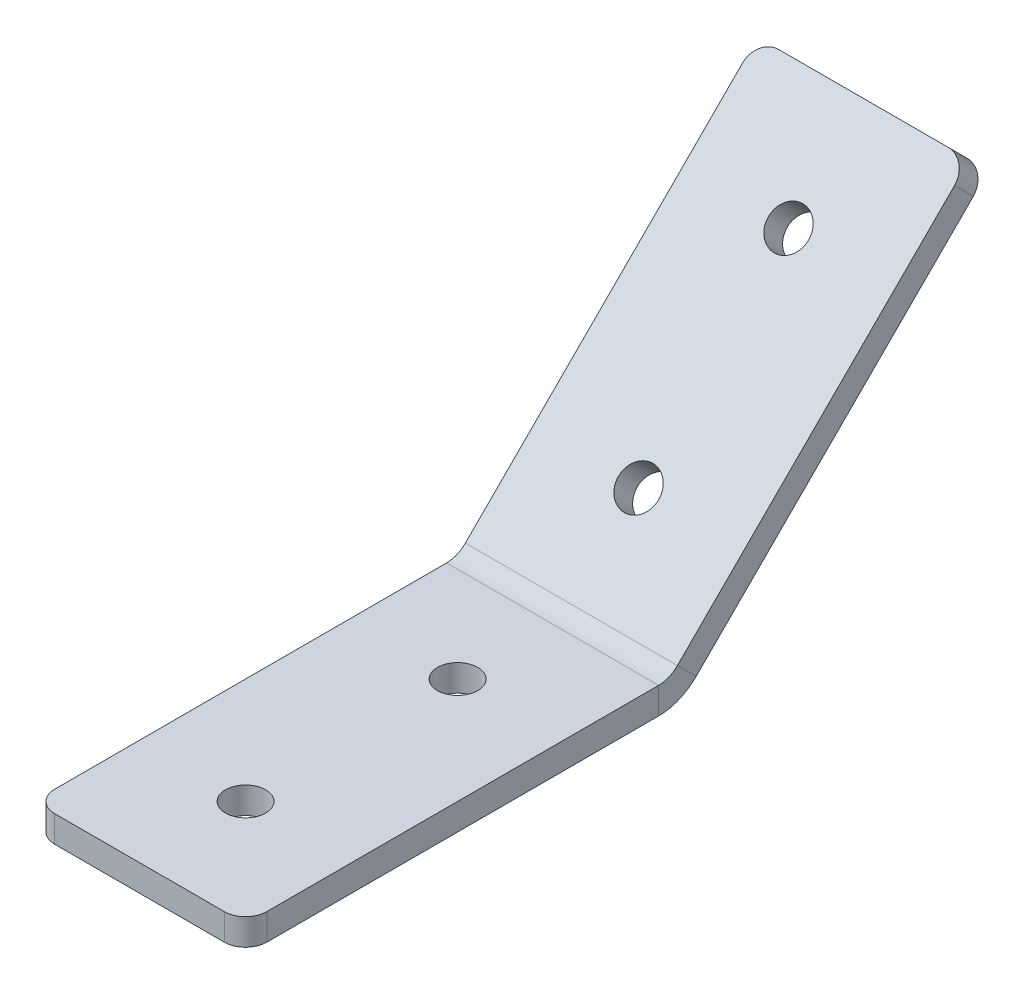
ISO-10303-21;
HEADER;
FILE_DESCRIPTION(('STEP AP214'),'2;1');
FILE_NAME('part.step','',(''),(''),'','','');
FILE_SCHEMA(('AUTOMOTIVE_DESIGN { 1 0 10303 214 1 1 1 1 }'));
ENDSEC;
DATA;
#1=APPLICATION_CONTEXT('core data for automotive mechanical design processes');
#2=APPLICATION_PROTOCOL_DEFINITION('international standard','automotive_design',2000,#1);
#3=PRODUCT_CONTEXT('',#1,'mechanical');
#4=PRODUCT('Part','Part','',(#3));
#5=PRODUCT_RELATED_PRODUCT_CATEGORY('part','',(#4));
#6=PRODUCT_DEFINITION_FORMATION('','',#4);
#7=PRODUCT_DEFINITION_CONTEXT('part definition',#1,'design');
#8=PRODUCT_DEFINITION('design','',#6,#7);
#9=PRODUCT_DEFINITION_SHAPE('','',#8);
#10=(LENGTH_UNIT() NAMED_UNIT(*) SI_UNIT(.MILLI.,.METRE.));
#11=(NAMED_UNIT(*) PLANE_ANGLE_UNIT() SI_UNIT($,.RADIAN.));
#12=(NAMED_UNIT(*) SI_UNIT($,.STERADIAN.) SOLID_ANGLE_UNIT());
#13=UNCERTAINTY_MEASURE_WITH_UNIT(LENGTH_MEASURE(1.E-05),#10,'distance_accuracy_value','');
#14=(GEOMETRIC_REPRESENTATION_CONTEXT(3) GLOBAL_UNCERTAINTY_ASSIGNED_CONTEXT((#13)) GLOBAL_UNIT_ASSIGNED_CONTEXT((#10,
#11,#12)) REPRESENTATION_CONTEXT('',''));
#15=CARTESIAN_POINT('',(0.,0.,0.));
#16=DIRECTION('',(0.,0.,1.));
#17=DIRECTION('',(1.,0.,0.));
#18=AXIS2_PLACEMENT_3D('',#15,#16,#17);
#19=CARTESIAN_POINT('',(0.,0.,-52.1151280605346));
#20=DIRECTION('',(1.,0.,0.));
#21=DIRECTION('',(0.,0.707106781186549,-0.707106781186546));
#22=AXIS2_PLACEMENT_3D('',#19,#20,#21);
#23=PLANE('',#22);
#24=DIRECTION('',(0.,-0.707106781186549,0.707106781186546));
#25=VECTOR('',#24,1.);
#26=CARTESIAN_POINT('',(0.,2.24506403026728,-49.8700640302673));
#27=LINE('',#26,#25);
#28=CARTESIAN_POINT('',(0.,4.10493596973272,-51.7299359697327));
#29=VERTEX_POINT('',#28);
#30=CARTESIAN_POINT('',(0.,37.2999732600629,-84.9249732600627));
#31=VERTEX_POINT('',#30);
#32=EDGE_CURVE('E225',#29,#31,#27,.F.);
#33=ORIENTED_EDGE('',*,*,#32,.T.);
#34=DIRECTION('',(0.,-0.707106781186546,-0.707106781186549));
#35=VECTOR('',#34,1.);
#36=CARTESIAN_POINT('',(0.,35.0549092297956,-87.17003729033));
#37=LINE('',#36,#35);
#38=CARTESIAN_POINT('',(0.,35.0549092297956,-87.17003729033));
#39=VERTEX_POINT('',#38);
#40=EDGE_CURVE('E11',#31,#39,#37,.T.);
#41=ORIENTED_EDGE('',*,*,#40,.T.);
#42=DIRECTION('',(0.,0.707106781186549,-0.707106781186546));
#43=VECTOR('',#42,1.);
#44=CARTESIAN_POINT('',(0.,0.,-52.1151280605346));
#45=LINE('',#44,#43);
#46=CARTESIAN_POINT('',(0.,1.85987193946543,-53.975));
#47=VERTEX_POINT('',#46);
#48=EDGE_CURVE('E161',#47,#39,#45,.T.);
#49=ORIENTED_EDGE('',*,*,#48,.F.);
#50=DIRECTION('',(0.,-0.707106781186546,-0.707106781186549));
#51=VECTOR('',#50,1.);
#52=CARTESIAN_POINT('',(0.,1.85987193946543,-53.975));
#53=LINE('',#52,#51);
#54=EDGE_CURVE('E133',#29,#47,#53,.T.);
#55=ORIENTED_EDGE('',*,*,#54,.F.);
#56=EDGE_LOOP('',(#33,#41,#49,#55));
#57=FACE_BOUND('',#56,.T.);
#58=ADVANCED_FACE('F39',(#57),#23,.F.);
#59=CARTESIAN_POINT('',(25.4,36.8509604540094,-88.9660885145438));
#60=DIRECTION('',(0.,0.707106781186549,-0.707106781186546));
#61=DIRECTION('',(-1.,0.,0.));
#62=AXIS2_PLACEMENT_3D('',#59,#60,#61);
#63=PLANE('',#62);
#64=DIRECTION('',(1.,0.,0.));
#65=VECTOR('',#64,1.);
#66=CARTESIAN_POINT('',(25.4,39.0960244842767,-86.7210244842765));
#67=LINE('',#66,#65);
#68=CARTESIAN_POINT('',(22.86,39.0960244842767,-86.7210244842765));
#69=VERTEX_POINT('',#68);
#70=CARTESIAN_POINT('',(2.53999999999999,39.0960244842767,-86.7210244842765));
#71=VERTEX_POINT('',#70);
#72=EDGE_CURVE('E222',#69,#71,#67,.F.);
#73=ORIENTED_EDGE('',*,*,#72,.F.);
#74=DIRECTION('',(0.,-0.707106781186546,-0.707106781186549));
#75=VECTOR('',#74,1.);
#76=CARTESIAN_POINT('',(22.86,36.8509604540094,-88.9660885145438));
#77=LINE('',#76,#75);
#78=CARTESIAN_POINT('',(22.86,36.8509604540094,-88.9660885145438));
#79=VERTEX_POINT('',#78);
#80=EDGE_CURVE('E273',#69,#79,#77,.T.);
#81=ORIENTED_EDGE('',*,*,#80,.T.);
#82=DIRECTION('',(-1.,0.,0.));
#83=VECTOR('',#82,1.);
#84=CARTESIAN_POINT('',(25.4,36.8509604540094,-88.9660885145438));
#85=LINE('',#84,#83);
#86=CARTESIAN_POINT('',(2.54,36.8509604540094,-88.9660885145438));
#87=VERTEX_POINT('',#86);
#88=EDGE_CURVE('E165',#79,#87,#85,.T.);
#89=ORIENTED_EDGE('',*,*,#88,.T.);
#90=DIRECTION('',(0.,0.707106781186546,0.707106781186549));
#91=VECTOR('',#90,1.);
#92=CARTESIAN_POINT('',(2.54,36.8509604540094,-88.9660885145438));
#93=LINE('',#92,#91);
#94=EDGE_CURVE('E270',#87,#71,#93,.T.);
#95=ORIENTED_EDGE('',*,*,#94,.T.);
#96=EDGE_LOOP('',(#73,#81,#89,#95));
#97=FACE_BOUND('',#96,.T.);
#98=ADVANCED_FACE('F294',(#97),#63,.T.);
#99=CARTESIAN_POINT('',(25.4,0.,-52.1151280605346));
#100=DIRECTION('',(1.,0.,0.));
#101=DIRECTION('',(0.,0.707106781186549,-0.707106781186546));
#102=AXIS2_PLACEMENT_3D('',#99,#100,#101);
#103=PLANE('',#102);
#104=DIRECTION('',(0.,0.707106781186549,-0.707106781186546));
#105=VECTOR('',#104,1.);
#106=CARTESIAN_POINT('',(25.4,0.,-52.1151280605346));
#107=LINE('',#106,#105);
#108=CARTESIAN_POINT('',(25.4,1.85987193946543,-53.975));
#109=VERTEX_POINT('',#108);
#110=CARTESIAN_POINT('',(25.4,35.0549092297956,-87.17003729033));
#111=VERTEX_POINT('',#110);
#112=EDGE_CURVE('E171',#109,#111,#107,.T.);
#113=ORIENTED_EDGE('',*,*,#112,.T.);
#114=DIRECTION('',(0.,-0.707106781186546,-0.707106781186549));
#115=VECTOR('',#114,1.);
#116=CARTESIAN_POINT('',(25.4,35.0549092297956,-87.17003729033));
#117=LINE('',#116,#115);
#118=CARTESIAN_POINT('',(25.4,37.2999732600629,-84.9249732600627));
#119=VERTEX_POINT('',#118);
#120=EDGE_CURVE('E63',#111,#119,#117,.F.);
#121=ORIENTED_EDGE('',*,*,#120,.T.);
#122=DIRECTION('',(0.,-0.707106781186549,0.707106781186546));
#123=VECTOR('',#122,1.);
#124=CARTESIAN_POINT('',(25.4,2.24506403026728,-49.8700640302673));
#125=LINE('',#124,#123);
#126=CARTESIAN_POINT('',(25.4,4.10493596973271,-51.7299359697327));
#127=VERTEX_POINT('',#126);
#128=EDGE_CURVE('E202',#127,#119,#125,.F.);
#129=ORIENTED_EDGE('',*,*,#128,.F.);
#130=DIRECTION('',(0.,-0.707106781186546,-0.707106781186549));
#131=VECTOR('',#130,1.);
#132=CARTESIAN_POINT('',(25.4,1.85987193946543,-53.975));
#133=LINE('',#132,#131);
#134=EDGE_CURVE('E146',#127,#109,#133,.T.);
#135=ORIENTED_EDGE('',*,*,#134,.T.);
#136=EDGE_LOOP('',(#113,#121,#129,#135));
#137=FACE_BOUND('',#136,.T.);
#138=ADVANCED_FACE('F298',(#137),#103,.T.);
#139=CARTESIAN_POINT('',(25.4,6.35,-49.4848719394654));
#140=DIRECTION('',(-1.,0.,0.));
#141=DIRECTION('',(0.,0.,1.));
#142=AXIS2_PLACEMENT_3D('',#139,#140,#141);
#143=PLANE('',#142);
#144=ORIENTED_EDGE('',*,*,#134,.F.);
#145=CARTESIAN_POINT('',(25.4,6.35,-49.4848719394654));
#146=DIRECTION('',(-1.,0.,0.));
#147=DIRECTION('',(0.,0.,1.));
#148=AXIS2_PLACEMENT_3D('',#145,#146,#147);
#149=CIRCLE('',#148,3.175);
#150=CARTESIAN_POINT('',(25.4,3.175,-49.4848719394654));
#151=VERTEX_POINT('',#150);
#152=EDGE_CURVE('E215',#127,#151,#149,.T.);
#153=ORIENTED_EDGE('',*,*,#152,.T.);
#154=DIRECTION('',(0.,-1.,0.));
#155=VECTOR('',#154,1.);
#156=CARTESIAN_POINT('',(25.4,0.,-49.4848719394654));
#157=LINE('',#156,#155);
#158=CARTESIAN_POINT('',(25.4,0.,-49.4848719394654));
#159=VERTEX_POINT('',#158);
#160=EDGE_CURVE('E236',#151,#159,#157,.T.);
#161=ORIENTED_EDGE('',*,*,#160,.T.);
#162=CARTESIAN_POINT('',(25.4,6.35,-49.4848719394654));
#163=DIRECTION('',(1.,0.,0.));
#164=DIRECTION('',(0.,0.,-1.));
#165=AXIS2_PLACEMENT_3D('',#162,#163,#164);
#166=CIRCLE('',#165,6.35);
#167=EDGE_CURVE('E157',#109,#159,#166,.F.);
#168=ORIENTED_EDGE('',*,*,#167,.F.);
#169=EDGE_LOOP('',(#144,#153,#161,#168));
#170=FACE_BOUND('',#169,.T.);
#171=ADVANCED_FACE('F323',(#170),#143,.F.);
#172=CARTESIAN_POINT('',(25.4,0.,0.));
#173=DIRECTION('',(1.,0.,0.));
#174=DIRECTION('',(0.,0.,-1.));
#175=AXIS2_PLACEMENT_3D('',#172,#173,#174);
#176=PLANE('',#175);
#177=DIRECTION('',(0.,0.,1.));
#178=VECTOR('',#177,1.);
#179=CARTESIAN_POINT('',(25.4,3.175,0.));
#180=LINE('',#179,#178);
#181=CARTESIAN_POINT('',(25.4,3.175,-2.54));
#182=VERTEX_POINT('',#181);
#183=EDGE_CURVE('E209',#182,#151,#180,.F.);
#184=ORIENTED_EDGE('',*,*,#183,.F.);
#185=DIRECTION('',(0.,1.,0.));
#186=VECTOR('',#185,1.);
#187=CARTESIAN_POINT('',(25.4,0.,-2.54));
#188=LINE('',#187,#186);
#189=CARTESIAN_POINT('',(25.4,0.,-2.54));
#190=VERTEX_POINT('',#189);
#191=EDGE_CURVE('E145',#182,#190,#188,.F.);
#192=ORIENTED_EDGE('',*,*,#191,.T.);
#193=DIRECTION('',(0.,0.,-1.));
#194=VECTOR('',#193,1.);
#195=CARTESIAN_POINT('',(25.4,0.,0.));
#196=LINE('',#195,#194);
#197=EDGE_CURVE('E183',#190,#159,#196,.T.);
#198=ORIENTED_EDGE('',*,*,#197,.T.);
#199=ORIENTED_EDGE('',*,*,#160,.F.);
#200=EDGE_LOOP('',(#184,#192,#198,#199));
#201=FACE_BOUND('',#200,.T.);
#202=ADVANCED_FACE('F319',(#201),#176,.T.);
#203=CARTESIAN_POINT('',(25.4,0.,0.));
#204=DIRECTION('',(0.,0.,-1.));
#205=DIRECTION('',(-1.,0.,0.));
#206=AXIS2_PLACEMENT_3D('',#203,#204,#205);
#207=PLANE('',#206);
#208=DIRECTION('',(-1.,0.,0.));
#209=VECTOR('',#208,1.);
#210=CARTESIAN_POINT('',(25.4,0.,0.));
#211=LINE('',#210,#209);
#212=CARTESIAN_POINT('',(22.86,0.,0.));
#213=VERTEX_POINT('',#212);
#214=CARTESIAN_POINT('',(2.54,0.,0.));
#215=VERTEX_POINT('',#214);
#216=EDGE_CURVE('E174',#213,#215,#211,.T.);
#217=ORIENTED_EDGE('',*,*,#216,.F.);
#218=DIRECTION('',(0.,-1.,0.));
#219=VECTOR('',#218,1.);
#220=CARTESIAN_POINT('',(22.86,0.,0.));
#221=LINE('',#220,#219);
#222=CARTESIAN_POINT('',(22.86,3.175,0.));
#223=VERTEX_POINT('',#222);
#224=EDGE_CURVE('E258',#213,#223,#221,.F.);
#225=ORIENTED_EDGE('',*,*,#224,.T.);
#226=DIRECTION('',(1.,0.,0.));
#227=VECTOR('',#226,1.);
#228=CARTESIAN_POINT('',(25.4,3.175,0.));
#229=LINE('',#228,#227);
#230=CARTESIAN_POINT('',(2.54,3.175,0.));
#231=VERTEX_POINT('',#230);
#232=EDGE_CURVE('E196',#223,#231,#229,.F.);
#233=ORIENTED_EDGE('',*,*,#232,.T.);
#234=DIRECTION('',(0.,1.,0.));
#235=VECTOR('',#234,1.);
#236=CARTESIAN_POINT('',(2.54,0.,0.));
#237=LINE('',#236,#235);
#238=EDGE_CURVE('E254',#231,#215,#237,.F.);
#239=ORIENTED_EDGE('',*,*,#238,.T.);
#240=EDGE_LOOP('',(#217,#225,#233,#239));
#241=FACE_BOUND('',#240,.T.);
#242=ADVANCED_FACE('F376',(#241),#207,.F.);
#243=CARTESIAN_POINT('',(0.,0.,0.));
#244=DIRECTION('',(1.,0.,0.));
#245=DIRECTION('',(0.,0.,-1.));
#246=AXIS2_PLACEMENT_3D('',#243,#244,#245);
#247=PLANE('',#246);
#248=DIRECTION('',(0.,0.,-1.));
#249=VECTOR('',#248,1.);
#250=CARTESIAN_POINT('',(0.,0.,0.));
#251=LINE('',#250,#249);
#252=CARTESIAN_POINT('',(0.,0.,-2.54));
#253=VERTEX_POINT('',#252);
#254=CARTESIAN_POINT('',(0.,0.,-49.4848719394654));
#255=VERTEX_POINT('',#254);
#256=EDGE_CURVE('E313',#253,#255,#251,.T.);
#257=ORIENTED_EDGE('',*,*,#256,.F.);
#258=DIRECTION('',(0.,1.,0.));
#259=VECTOR('',#258,1.);
#260=CARTESIAN_POINT('',(0.,0.,-2.54));
#261=LINE('',#260,#259);
#262=CARTESIAN_POINT('',(0.,3.175,-2.54));
#263=VERTEX_POINT('',#262);
#264=EDGE_CURVE('E267',#253,#263,#261,.T.);
#265=ORIENTED_EDGE('',*,*,#264,.T.);
#266=DIRECTION('',(0.,0.,1.));
#267=VECTOR('',#266,1.);
#268=CARTESIAN_POINT('',(0.,3.175,0.));
#269=LINE('',#268,#267);
#270=CARTESIAN_POINT('',(0.,3.175,-49.4848719394654));
#271=VERTEX_POINT('',#270);
#272=EDGE_CURVE('E206',#263,#271,#269,.F.);
#273=ORIENTED_EDGE('',*,*,#272,.T.);
#274=DIRECTION('',(0.,-1.,0.));
#275=VECTOR('',#274,1.);
#276=CARTESIAN_POINT('',(0.,0.,-49.4848719394654));
#277=LINE('',#276,#275);
#278=EDGE_CURVE('E179',#271,#255,#277,.T.);
#279=ORIENTED_EDGE('',*,*,#278,.T.);
#280=EDGE_LOOP('',(#257,#265,#273,#279));
#281=FACE_BOUND('',#280,.T.);
#282=ADVANCED_FACE('F329',(#281),#247,.F.);
#283=CARTESIAN_POINT('',(12.7,27.8707043329402,-79.9858323934747));
#284=DIRECTION('',(0.,0.707106781186546,0.707106781186549));
#285=DIRECTION('',(0.,-0.707106781186549,0.707106781186546));
#286=AXIS2_PLACEMENT_3D('',#283,#284,#285);
#287=CYLINDRICAL_SURFACE('',#286,2.413);
#288=CARTESIAN_POINT('',(12.7,27.8707043329402,-79.9858323934747));
#289=DIRECTION('',(0.,0.707106781186546,0.707106781186549));
#290=DIRECTION('',(0.,-0.707106781186549,0.707106781186546));
#291=AXIS2_PLACEMENT_3D('',#288,#289,#290);
#292=CIRCLE('',#291,2.413);
#293=CARTESIAN_POINT('',(12.7,26.1644556699371,-78.2795837304716));
#294=VERTEX_POINT('',#293);
#295=EDGE_CURVE('E189',#294,#294,#292,.F.);
#296=ORIENTED_EDGE('',*,*,#295,.T.);
#297=EDGE_LOOP('',(#296));
#298=FACE_BOUND('',#297,.T.);
#299=CARTESIAN_POINT('',(12.7,30.1157683632075,-77.7407683632074));
#300=DIRECTION('',(0.,0.707106781186546,0.707106781186549));
#301=DIRECTION('',(0.,-0.707106781186549,0.707106781186546));
#302=AXIS2_PLACEMENT_3D('',#299,#300,#301);
#303=CIRCLE('',#302,2.413);
#304=CARTESIAN_POINT('',(12.7,28.4095197002044,-76.0345197002043));
#305=VERTEX_POINT('',#304);
#306=EDGE_CURVE('E219',#305,#305,#303,.F.);
#307=ORIENTED_EDGE('',*,*,#306,.F.);
#308=EDGE_LOOP('',(#307));
#309=FACE_BOUND('',#308,.T.);
#310=ADVANCED_FACE('F355',(#298,#309),#287,.F.);
#311=CARTESIAN_POINT('',(12.7,9.9101920908019,-62.0253201513365));
#312=DIRECTION('',(0.,0.707106781186546,0.707106781186549));
#313=DIRECTION('',(0.,-0.707106781186549,0.707106781186546));
#314=AXIS2_PLACEMENT_3D('',#311,#312,#313);
#315=CYLINDRICAL_SURFACE('',#314,2.413);
#316=CARTESIAN_POINT('',(12.7,9.9101920908019,-62.0253201513365));
#317=DIRECTION('',(0.,0.707106781186546,0.707106781186549));
#318=DIRECTION('',(0.,-0.707106781186549,0.707106781186546));
#319=AXIS2_PLACEMENT_3D('',#316,#317,#318);
#320=CIRCLE('',#319,2.413);
#321=CARTESIAN_POINT('',(12.7,8.20394342779876,-60.3190714883333));
#322=VERTEX_POINT('',#321);
#323=EDGE_CURVE('E166',#322,#322,#320,.F.);
#324=ORIENTED_EDGE('',*,*,#323,.T.);
#325=EDGE_LOOP('',(#324));
#326=FACE_BOUND('',#325,.T.);
#327=CARTESIAN_POINT('',(12.7,12.1552561210692,-59.7802561210692));
#328=DIRECTION('',(0.,0.707106781186546,0.707106781186549));
#329=DIRECTION('',(0.,-0.707106781186549,0.707106781186546));
#330=AXIS2_PLACEMENT_3D('',#327,#328,#329);
#331=CIRCLE('',#330,2.413);
#332=CARTESIAN_POINT('',(12.7,10.449007458066,-58.074007458066));
#333=VERTEX_POINT('',#332);
#334=EDGE_CURVE('E228',#333,#333,#331,.F.);
#335=ORIENTED_EDGE('',*,*,#334,.F.);
#336=EDGE_LOOP('',(#335));
#337=FACE_BOUND('',#336,.T.);
#338=ADVANCED_FACE('F358',(#326,#337),#315,.F.);
#339=CARTESIAN_POINT('',(12.7,0.,-12.7));
#340=DIRECTION('',(0.,1.,0.));
#341=DIRECTION('',(0.,0.,1.));
#342=AXIS2_PLACEMENT_3D('',#339,#340,#341);
#343=CYLINDRICAL_SURFACE('',#342,2.413);
#344=CARTESIAN_POINT('',(12.7,0.,-12.7));
#345=DIRECTION('',(0.,1.,0.));
#346=DIRECTION('',(0.,0.,1.));
#347=AXIS2_PLACEMENT_3D('',#344,#345,#346);
#348=CIRCLE('',#347,2.413);
#349=CARTESIAN_POINT('',(12.7,0.,-10.287));
#350=VERTEX_POINT('',#349);
#351=EDGE_CURVE('E300',#350,#350,#348,.F.);
#352=ORIENTED_EDGE('',*,*,#351,.T.);
#353=EDGE_LOOP('',(#352));
#354=FACE_BOUND('',#353,.T.);
#355=CARTESIAN_POINT('',(12.7,3.175,-12.7));
#356=DIRECTION('',(0.,1.,0.));
#357=DIRECTION('',(0.,0.,1.));
#358=AXIS2_PLACEMENT_3D('',#355,#356,#357);
#359=CIRCLE('',#358,2.413);
#360=CARTESIAN_POINT('',(12.7,3.175,-10.287));
#361=VERTEX_POINT('',#360);
#362=EDGE_CURVE('E197',#361,#361,#359,.F.);
#363=ORIENTED_EDGE('',*,*,#362,.F.);
#364=EDGE_LOOP('',(#363));
#365=FACE_BOUND('',#364,.T.);
#366=ADVANCED_FACE('F362',(#354,#365),#343,.F.);
#367=CARTESIAN_POINT('',(12.7,0.,-38.1));
#368=DIRECTION('',(0.,1.,0.));
#369=DIRECTION('',(0.,0.,1.));
#370=AXIS2_PLACEMENT_3D('',#367,#368,#369);
#371=CYLINDRICAL_SURFACE('',#370,2.413);
#372=CARTESIAN_POINT('',(12.7,0.,-38.1));
#373=DIRECTION('',(0.,1.,0.));
#374=DIRECTION('',(0.,0.,1.));
#375=AXIS2_PLACEMENT_3D('',#372,#373,#374);
#376=CIRCLE('',#375,2.413);
#377=CARTESIAN_POINT('',(12.7,0.,-35.687));
#378=VERTEX_POINT('',#377);
#379=EDGE_CURVE('E305',#378,#378,#376,.F.);
#380=ORIENTED_EDGE('',*,*,#379,.T.);
#381=EDGE_LOOP('',(#380));
#382=FACE_BOUND('',#381,.T.);
#383=CARTESIAN_POINT('',(12.7,3.175,-38.1));
#384=DIRECTION('',(0.,1.,0.));
#385=DIRECTION('',(0.,0.,1.));
#386=AXIS2_PLACEMENT_3D('',#383,#384,#385);
#387=CIRCLE('',#386,2.413);
#388=CARTESIAN_POINT('',(12.7,3.175,-35.687));
#389=VERTEX_POINT('',#388);
#390=EDGE_CURVE('E201',#389,#389,#387,.F.);
#391=ORIENTED_EDGE('',*,*,#390,.F.);
#392=EDGE_LOOP('',(#391));
#393=FACE_BOUND('',#392,.T.);
#394=ADVANCED_FACE('F354',(#382,#393),#371,.F.);
#395=CARTESIAN_POINT('',(0.,6.35,-49.4848719394654));
#396=DIRECTION('',(1.,0.,0.));
#397=DIRECTION('',(0.,0.,-1.));
#398=AXIS2_PLACEMENT_3D('',#395,#396,#397);
#399=PLANE('',#398);
#400=CARTESIAN_POINT('',(0.,6.35,-49.4848719394654));
#401=DIRECTION('',(-1.,0.,0.));
#402=DIRECTION('',(0.,0.,1.));
#403=AXIS2_PLACEMENT_3D('',#400,#401,#402);
#404=CIRCLE('',#403,3.175);
#405=EDGE_CURVE('E140',#271,#29,#404,.F.);
#406=ORIENTED_EDGE('',*,*,#405,.T.);
#407=ORIENTED_EDGE('',*,*,#54,.T.);
#408=CARTESIAN_POINT('',(0.,6.35,-49.4848719394654));
#409=DIRECTION('',(-1.,0.,0.));
#410=DIRECTION('',(0.,0.,1.));
#411=AXIS2_PLACEMENT_3D('',#408,#409,#410);
#412=CIRCLE('',#411,6.35);
#413=EDGE_CURVE('E137',#255,#47,#412,.F.);
#414=ORIENTED_EDGE('',*,*,#413,.F.);
#415=ORIENTED_EDGE('',*,*,#278,.F.);
#416=EDGE_LOOP('',(#406,#407,#414,#415));
#417=FACE_BOUND('',#416,.T.);
#418=ADVANCED_FACE('F135',(#417),#399,.F.);
#419=CARTESIAN_POINT('',(25.4,0.,0.));
#420=DIRECTION('',(0.,1.,0.));
#421=DIRECTION('',(0.,0.,1.));
#422=AXIS2_PLACEMENT_3D('',#419,#420,#421);
#423=PLANE('',#422);
#424=ORIENTED_EDGE('',*,*,#351,.F.);
#425=EDGE_LOOP('',(#424));
#426=FACE_BOUND('',#425,.T.);
#427=ORIENTED_EDGE('',*,*,#379,.F.);
#428=EDGE_LOOP('',(#427));
#429=FACE_BOUND('',#428,.T.);
#430=ORIENTED_EDGE('',*,*,#197,.F.);
#431=CARTESIAN_POINT('',(22.86,0.,-2.54));
#432=DIRECTION('',(0.,1.,0.));
#433=DIRECTION('',(0.,0.,1.));
#434=AXIS2_PLACEMENT_3D('',#431,#432,#433);
#435=CIRCLE('',#434,2.54);
#436=EDGE_CURVE('E251',#190,#213,#435,.F.);
#437=ORIENTED_EDGE('',*,*,#436,.T.);
#438=ORIENTED_EDGE('',*,*,#216,.T.);
#439=CARTESIAN_POINT('',(2.54,0.,-2.54));
#440=DIRECTION('',(0.,1.,0.));
#441=DIRECTION('',(0.,0.,1.));
#442=AXIS2_PLACEMENT_3D('',#439,#440,#441);
#443=CIRCLE('',#442,2.54);
#444=EDGE_CURVE('E248',#215,#253,#443,.F.);
#445=ORIENTED_EDGE('',*,*,#444,.T.);
#446=ORIENTED_EDGE('',*,*,#256,.T.);
#447=DIRECTION('',(-1.,0.,0.));
#448=VECTOR('',#447,1.);
#449=CARTESIAN_POINT('',(25.4,0.,-49.4848719394654));
#450=LINE('',#449,#448);
#451=EDGE_CURVE('E155',#255,#159,#450,.F.);
#452=ORIENTED_EDGE('',*,*,#451,.T.);
#453=EDGE_LOOP('',(#430,#437,#438,#445,#446,#452));
#454=FACE_BOUND('',#453,.T.);
#455=ADVANCED_FACE('F325',(#426,#429,#454),#423,.F.);
#456=CARTESIAN_POINT('',(25.4,0.,-52.1151280605346));
#457=DIRECTION('',(0.,0.707106781186546,0.707106781186549));
#458=DIRECTION('',(0.,-0.707106781186549,0.707106781186546));
#459=AXIS2_PLACEMENT_3D('',#456,#457,#458);
#460=PLANE('',#459);
#461=ORIENTED_EDGE('',*,*,#295,.F.);
#462=EDGE_LOOP('',(#461));
#463=FACE_BOUND('',#462,.T.);
#464=ORIENTED_EDGE('',*,*,#323,.F.);
#465=EDGE_LOOP('',(#464));
#466=FACE_BOUND('',#465,.T.);
#467=ORIENTED_EDGE('',*,*,#88,.F.);
#468=CARTESIAN_POINT('',(22.86,35.0549092297956,-87.17003729033));
#469=DIRECTION('',(0.,0.707106781186546,0.707106781186549));
#470=DIRECTION('',(0.,-0.707106781186549,0.707106781186546));
#471=AXIS2_PLACEMENT_3D('',#468,#469,#470);
#472=CIRCLE('',#471,2.54);
#473=EDGE_CURVE('E280',#79,#111,#472,.F.);
#474=ORIENTED_EDGE('',*,*,#473,.T.);
#475=ORIENTED_EDGE('',*,*,#112,.F.);
#476=DIRECTION('',(-1.,0.,0.));
#477=VECTOR('',#476,1.);
#478=CARTESIAN_POINT('',(25.4,1.85987193946543,-53.975));
#479=LINE('',#478,#477);
#480=EDGE_CURVE('E153',#109,#47,#479,.T.);
#481=ORIENTED_EDGE('',*,*,#480,.T.);
#482=ORIENTED_EDGE('',*,*,#48,.T.);
#483=CARTESIAN_POINT('',(2.54,35.0549092297956,-87.17003729033));
#484=DIRECTION('',(0.,0.707106781186546,0.707106781186549));
#485=DIRECTION('',(0.,-0.707106781186549,0.707106781186546));
#486=AXIS2_PLACEMENT_3D('',#483,#484,#485);
#487=CIRCLE('',#486,2.54);
#488=EDGE_CURVE('E277',#39,#87,#487,.F.);
#489=ORIENTED_EDGE('',*,*,#488,.T.);
#490=EDGE_LOOP('',(#467,#474,#475,#481,#482,#489));
#491=FACE_BOUND('',#490,.T.);
#492=ADVANCED_FACE('F170',(#463,#466,#491),#460,.F.);
#493=CARTESIAN_POINT('',(25.4,6.35,-49.4848719394654));
#494=DIRECTION('',(-1.,0.,0.));
#495=DIRECTION('',(0.,0.,1.));
#496=AXIS2_PLACEMENT_3D('',#493,#494,#495);
#497=CYLINDRICAL_SURFACE('',#496,6.35);
#498=ORIENTED_EDGE('',*,*,#167,.T.);
#499=ORIENTED_EDGE('',*,*,#451,.F.);
#500=ORIENTED_EDGE('',*,*,#413,.T.);
#501=ORIENTED_EDGE('',*,*,#480,.F.);
#502=EDGE_LOOP('',(#498,#499,#500,#501));
#503=FACE_BOUND('',#502,.T.);
#504=ADVANCED_FACE('F151',(#503),#497,.T.);
#505=CARTESIAN_POINT('',(25.4,3.175,0.));
#506=DIRECTION('',(0.,1.,0.));
#507=DIRECTION('',(0.,0.,1.));
#508=AXIS2_PLACEMENT_3D('',#505,#506,#507);
#509=PLANE('',#508);
#510=ORIENTED_EDGE('',*,*,#362,.T.);
#511=EDGE_LOOP('',(#510));
#512=FACE_BOUND('',#511,.T.);
#513=ORIENTED_EDGE('',*,*,#390,.T.);
#514=EDGE_LOOP('',(#513));
#515=FACE_BOUND('',#514,.T.);
#516=ORIENTED_EDGE('',*,*,#232,.F.);
#517=CARTESIAN_POINT('',(22.86,3.175,-2.54));
#518=DIRECTION('',(0.,1.,0.));
#519=DIRECTION('',(0.,0.,1.));
#520=AXIS2_PLACEMENT_3D('',#517,#518,#519);
#521=CIRCLE('',#520,2.54);
#522=EDGE_CURVE('E264',#223,#182,#521,.T.);
#523=ORIENTED_EDGE('',*,*,#522,.T.);
#524=ORIENTED_EDGE('',*,*,#183,.T.);
#525=DIRECTION('',(1.,0.,0.));
#526=VECTOR('',#525,1.);
#527=CARTESIAN_POINT('',(25.4,3.175,-49.4848719394654));
#528=LINE('',#527,#526);
#529=EDGE_CURVE('E158',#271,#151,#528,.T.);
#530=ORIENTED_EDGE('',*,*,#529,.F.);
#531=ORIENTED_EDGE('',*,*,#272,.F.);
#532=CARTESIAN_POINT('',(2.54,3.175,-2.54));
#533=DIRECTION('',(0.,1.,0.));
#534=DIRECTION('',(0.,0.,1.));
#535=AXIS2_PLACEMENT_3D('',#532,#533,#534);
#536=CIRCLE('',#535,2.54);
#537=EDGE_CURVE('E261',#263,#231,#536,.T.);
#538=ORIENTED_EDGE('',*,*,#537,.T.);
#539=EDGE_LOOP('',(#516,#523,#524,#530,#531,#538));
#540=FACE_BOUND('',#539,.T.);
#541=ADVANCED_FACE('F334',(#512,#515,#540),#509,.T.);
#542=CARTESIAN_POINT('',(25.4,2.24506403026728,-49.8700640302673));
#543=DIRECTION('',(0.,0.707106781186546,0.707106781186549));
#544=DIRECTION('',(0.,-0.707106781186549,0.707106781186546));
#545=AXIS2_PLACEMENT_3D('',#542,#543,#544);
#546=PLANE('',#545);
#547=ORIENTED_EDGE('',*,*,#306,.T.);
#548=EDGE_LOOP('',(#547));
#549=FACE_BOUND('',#548,.T.);
#550=ORIENTED_EDGE('',*,*,#334,.T.);
#551=EDGE_LOOP('',(#550));
#552=FACE_BOUND('',#551,.T.);
#553=ORIENTED_EDGE('',*,*,#128,.T.);
#554=CARTESIAN_POINT('',(22.86,37.2999732600629,-84.9249732600627));
#555=DIRECTION('',(0.,0.707106781186546,0.707106781186549));
#556=DIRECTION('',(0.,-0.707106781186549,0.707106781186546));
#557=AXIS2_PLACEMENT_3D('',#554,#555,#556);
#558=CIRCLE('',#557,2.54);
#559=EDGE_CURVE('E48',#119,#69,#558,.T.);
#560=ORIENTED_EDGE('',*,*,#559,.T.);
#561=ORIENTED_EDGE('',*,*,#72,.T.);
#562=CARTESIAN_POINT('',(2.54,37.2999732600629,-84.9249732600627));
#563=DIRECTION('',(0.,0.707106781186546,0.707106781186549));
#564=DIRECTION('',(0.,-0.707106781186549,0.707106781186546));
#565=AXIS2_PLACEMENT_3D('',#562,#563,#564);
#566=CIRCLE('',#565,2.54);
#567=EDGE_CURVE('E55',#71,#31,#566,.T.);
#568=ORIENTED_EDGE('',*,*,#567,.T.);
#569=ORIENTED_EDGE('',*,*,#32,.F.);
#570=DIRECTION('',(1.,0.,0.));
#571=VECTOR('',#570,1.);
#572=CARTESIAN_POINT('',(25.4,4.10493596973271,-51.7299359697327));
#573=LINE('',#572,#571);
#574=EDGE_CURVE('E193',#127,#29,#573,.F.);
#575=ORIENTED_EDGE('',*,*,#574,.F.);
#576=EDGE_LOOP('',(#553,#560,#561,#568,#569,#575));
#577=FACE_BOUND('',#576,.T.);
#578=ADVANCED_FACE('F289',(#549,#552,#577),#546,.T.);
#579=CARTESIAN_POINT('',(25.4,6.35,-49.4848719394654));
#580=DIRECTION('',(-1.,0.,0.));
#581=DIRECTION('',(0.,0.,1.));
#582=AXIS2_PLACEMENT_3D('',#579,#580,#581);
#583=CYLINDRICAL_SURFACE('',#582,3.175);
#584=ORIENTED_EDGE('',*,*,#152,.F.);
#585=ORIENTED_EDGE('',*,*,#574,.T.);
#586=ORIENTED_EDGE('',*,*,#405,.F.);
#587=ORIENTED_EDGE('',*,*,#529,.T.);
#588=EDGE_LOOP('',(#584,#585,#586,#587));
#589=FACE_BOUND('',#588,.T.);
#590=ADVANCED_FACE('F337',(#589),#583,.F.);
#591=CARTESIAN_POINT('',(22.86,0.,-2.54));
#592=DIRECTION('',(0.,1.,0.));
#593=DIRECTION('',(0.,0.,1.));
#594=AXIS2_PLACEMENT_3D('',#591,#592,#593);
#595=CYLINDRICAL_SURFACE('',#594,2.54);
#596=ORIENTED_EDGE('',*,*,#522,.F.);
#597=ORIENTED_EDGE('',*,*,#224,.F.);
#598=ORIENTED_EDGE('',*,*,#436,.F.);
#599=ORIENTED_EDGE('',*,*,#191,.F.);
#600=EDGE_LOOP('',(#596,#597,#598,#599));
#601=FACE_BOUND('',#600,.T.);
#602=ADVANCED_FACE('F364',(#601),#595,.T.);
#603=CARTESIAN_POINT('',(2.54,0.,-2.54));
#604=DIRECTION('',(0.,-1.,0.));
#605=DIRECTION('',(0.,0.,-1.));
#606=AXIS2_PLACEMENT_3D('',#603,#604,#605);
#607=CYLINDRICAL_SURFACE('',#606,2.54);
#608=ORIENTED_EDGE('',*,*,#537,.F.);
#609=ORIENTED_EDGE('',*,*,#264,.F.);
#610=ORIENTED_EDGE('',*,*,#444,.F.);
#611=ORIENTED_EDGE('',*,*,#238,.F.);
#612=EDGE_LOOP('',(#608,#609,#610,#611));
#613=FACE_BOUND('',#612,.T.);
#614=ADVANCED_FACE('F343',(#613),#607,.T.);
#615=CARTESIAN_POINT('',(22.86,35.0549092297956,-87.17003729033));
#616=DIRECTION('',(0.,-0.707106781186546,-0.707106781186549));
#617=DIRECTION('',(0.,0.707106781186549,-0.707106781186546));
#618=AXIS2_PLACEMENT_3D('',#615,#616,#617);
#619=CYLINDRICAL_SURFACE('',#618,2.54);
#620=ORIENTED_EDGE('',*,*,#559,.F.);
#621=ORIENTED_EDGE('',*,*,#120,.F.);
#622=ORIENTED_EDGE('',*,*,#473,.F.);
#623=ORIENTED_EDGE('',*,*,#80,.F.);
#624=EDGE_LOOP('',(#620,#621,#622,#623));
#625=FACE_BOUND('',#624,.T.);
#626=ADVANCED_FACE('F297',(#625),#619,.T.);
#627=CARTESIAN_POINT('',(2.54,35.0549092297956,-87.17003729033));
#628=DIRECTION('',(0.,0.707106781186546,0.707106781186549));
#629=DIRECTION('',(0.,-0.707106781186549,0.707106781186546));
#630=AXIS2_PLACEMENT_3D('',#627,#628,#629);
#631=CYLINDRICAL_SURFACE('',#630,2.54);
#632=ORIENTED_EDGE('',*,*,#567,.F.);
#633=ORIENTED_EDGE('',*,*,#94,.F.);
#634=ORIENTED_EDGE('',*,*,#488,.F.);
#635=ORIENTED_EDGE('',*,*,#40,.F.);
#636=EDGE_LOOP('',(#632,#633,#634,#635));
#637=FACE_BOUND('',#636,.T.);
#638=ADVANCED_FACE('F41',(#637),#631,.T.);
#639=CLOSED_SHELL('',(#58,#98,#138,#171,#202,#242,#282,#310,#338,#366,#394,#418,#455,#492,#504,
#541,#578,#590,#602,#614,#626,#638));
#640=MANIFOLD_SOLID_BREP('B2',#639);
#641=ADVANCED_BREP_SHAPE_REPRESENTATION('',(#18,#640),#14);
#642=SHAPE_DEFINITION_REPRESENTATION(#9,#641);
ENDSEC;
END-ISO-10303-21;
